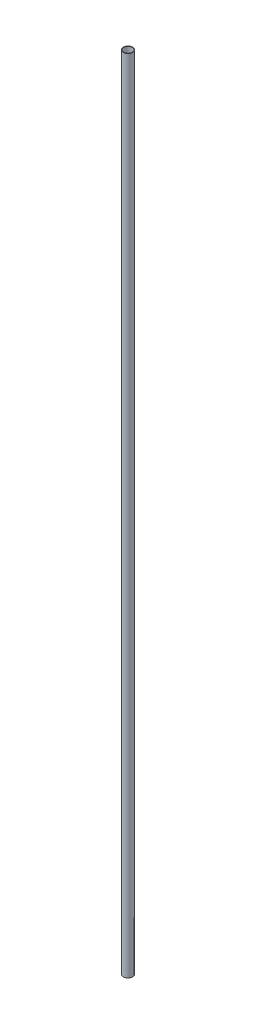
ISO-10303-21;
HEADER;
FILE_DESCRIPTION(('STEP AP214'),'2;1');
FILE_NAME('part.step','',(''),(''),'','','');
FILE_SCHEMA(('AUTOMOTIVE_DESIGN { 1 0 10303 214 1 1 1 1 }'));
ENDSEC;
DATA;
#1=APPLICATION_CONTEXT('core data for automotive mechanical design processes');
#2=APPLICATION_PROTOCOL_DEFINITION('international standard','automotive_design',2000,#1);
#3=PRODUCT_CONTEXT('',#1,'mechanical');
#4=PRODUCT('Part','Part','',(#3));
#5=PRODUCT_RELATED_PRODUCT_CATEGORY('part','',(#4));
#6=PRODUCT_DEFINITION_FORMATION('','',#4);
#7=PRODUCT_DEFINITION_CONTEXT('part definition',#1,'design');
#8=PRODUCT_DEFINITION('design','',#6,#7);
#9=PRODUCT_DEFINITION_SHAPE('','',#8);
#10=(LENGTH_UNIT() NAMED_UNIT(*) SI_UNIT(.MILLI.,.METRE.));
#11=(NAMED_UNIT(*) PLANE_ANGLE_UNIT() SI_UNIT($,.RADIAN.));
#12=(NAMED_UNIT(*) SI_UNIT($,.STERADIAN.) SOLID_ANGLE_UNIT());
#13=UNCERTAINTY_MEASURE_WITH_UNIT(LENGTH_MEASURE(1.E-05),#10,'distance_accuracy_value','');
#14=(GEOMETRIC_REPRESENTATION_CONTEXT(3) GLOBAL_UNCERTAINTY_ASSIGNED_CONTEXT((#13)) GLOBAL_UNIT_ASSIGNED_CONTEXT((#10,
#11,#12)) REPRESENTATION_CONTEXT('',''));
#15=CARTESIAN_POINT('',(0.,0.,0.));
#16=DIRECTION('',(0.,0.,1.));
#17=DIRECTION('',(1.,0.,0.));
#18=AXIS2_PLACEMENT_3D('',#15,#16,#17);
#19=CARTESIAN_POINT('',(0.,1803.4,0.));
#20=DIRECTION('',(0.,1.,0.));
#21=DIRECTION('',(0.,0.,0.999999999999998));
#22=AXIS2_PLACEMENT_3D('',#19,#20,#21);
#23=PLANE('',#22);
#24=CARTESIAN_POINT('',(0.,1803.4,0.));
#25=DIRECTION('',(0.,1.,0.));
#26=DIRECTION('',(0.,0.,0.999999999999998));
#27=AXIS2_PLACEMENT_3D('',#24,#25,#26);
#28=CIRCLE('',#27,10.541);
#29=CARTESIAN_POINT('',(0.,1803.4,10.541));
#30=VERTEX_POINT('',#29);
#31=EDGE_CURVE('E12',#30,#30,#28,.T.);
#32=ORIENTED_EDGE('',*,*,#31,.T.);
#33=EDGE_LOOP('',(#32));
#34=FACE_BOUND('',#33,.T.);
#35=CARTESIAN_POINT('',(0.,1803.4,0.));
#36=DIRECTION('',(0.,1.,0.));
#37=DIRECTION('',(0.,0.,0.999999999999998));
#38=AXIS2_PLACEMENT_3D('',#35,#36,#37);
#39=CIRCLE('',#38,9.525);
#40=CARTESIAN_POINT('',(0.,1803.4,9.52499999999998));
#41=VERTEX_POINT('',#40);
#42=EDGE_CURVE('E62',#41,#41,#39,.T.);
#43=ORIENTED_EDGE('',*,*,#42,.F.);
#44=EDGE_LOOP('',(#43));
#45=FACE_BOUND('',#44,.T.);
#46=ADVANCED_FACE('F48',(#34,#45),#23,.T.);
#47=CARTESIAN_POINT('',(0.,0.,0.));
#48=DIRECTION('',(0.,1.,0.));
#49=DIRECTION('',(0.,0.,0.999999999999998));
#50=AXIS2_PLACEMENT_3D('',#47,#48,#49);
#51=PLANE('',#50);
#52=CARTESIAN_POINT('',(0.,0.,0.));
#53=DIRECTION('',(0.,1.,0.));
#54=DIRECTION('',(0.,0.,0.999999999999998));
#55=AXIS2_PLACEMENT_3D('',#52,#53,#54);
#56=CIRCLE('',#55,10.541);
#57=CARTESIAN_POINT('',(0.,0.,10.541));
#58=VERTEX_POINT('',#57);
#59=EDGE_CURVE('E52',#58,#58,#56,.T.);
#60=ORIENTED_EDGE('',*,*,#59,.F.);
#61=EDGE_LOOP('',(#60));
#62=FACE_BOUND('',#61,.T.);
#63=CARTESIAN_POINT('',(0.,0.,0.));
#64=DIRECTION('',(0.,1.,0.));
#65=DIRECTION('',(0.,0.,0.999999999999998));
#66=AXIS2_PLACEMENT_3D('',#63,#64,#65);
#67=CIRCLE('',#66,9.525);
#68=CARTESIAN_POINT('',(0.,0.,9.52499999999998));
#69=VERTEX_POINT('',#68);
#70=EDGE_CURVE('E64',#69,#69,#67,.T.);
#71=ORIENTED_EDGE('',*,*,#70,.T.);
#72=EDGE_LOOP('',(#71));
#73=FACE_BOUND('',#72,.T.);
#74=ADVANCED_FACE('F75',(#62,#73),#51,.F.);
#75=CARTESIAN_POINT('',(0.,1803.4,0.));
#76=DIRECTION('',(0.,-1.,0.));
#77=DIRECTION('',(0.,0.,-0.999999999999998));
#78=AXIS2_PLACEMENT_3D('',#75,#76,#77);
#79=CYLINDRICAL_SURFACE('',#78,10.541);
#80=ORIENTED_EDGE('',*,*,#31,.F.);
#81=EDGE_LOOP('',(#80));
#82=FACE_BOUND('',#81,.T.);
#83=ORIENTED_EDGE('',*,*,#59,.T.);
#84=EDGE_LOOP('',(#83));
#85=FACE_BOUND('',#84,.T.);
#86=ADVANCED_FACE('F50',(#82,#85),#79,.T.);
#87=CARTESIAN_POINT('',(0.,1803.4,0.));
#88=DIRECTION('',(0.,-1.,0.));
#89=DIRECTION('',(0.,0.,-0.999999999999998));
#90=AXIS2_PLACEMENT_3D('',#87,#88,#89);
#91=CYLINDRICAL_SURFACE('',#90,9.525);
#92=ORIENTED_EDGE('',*,*,#42,.T.);
#93=EDGE_LOOP('',(#92));
#94=FACE_BOUND('',#93,.T.);
#95=ORIENTED_EDGE('',*,*,#70,.F.);
#96=EDGE_LOOP('',(#95));
#97=FACE_BOUND('',#96,.T.);
#98=ADVANCED_FACE('F71',(#94,#97),#91,.F.);
#99=CLOSED_SHELL('',(#46,#74,#86,#98));
#100=MANIFOLD_SOLID_BREP('B2',#99);
#101=ADVANCED_BREP_SHAPE_REPRESENTATION('',(#18,#100),#14);
#102=SHAPE_DEFINITION_REPRESENTATION(#9,#101);
ENDSEC;
END-ISO-10303-21;
